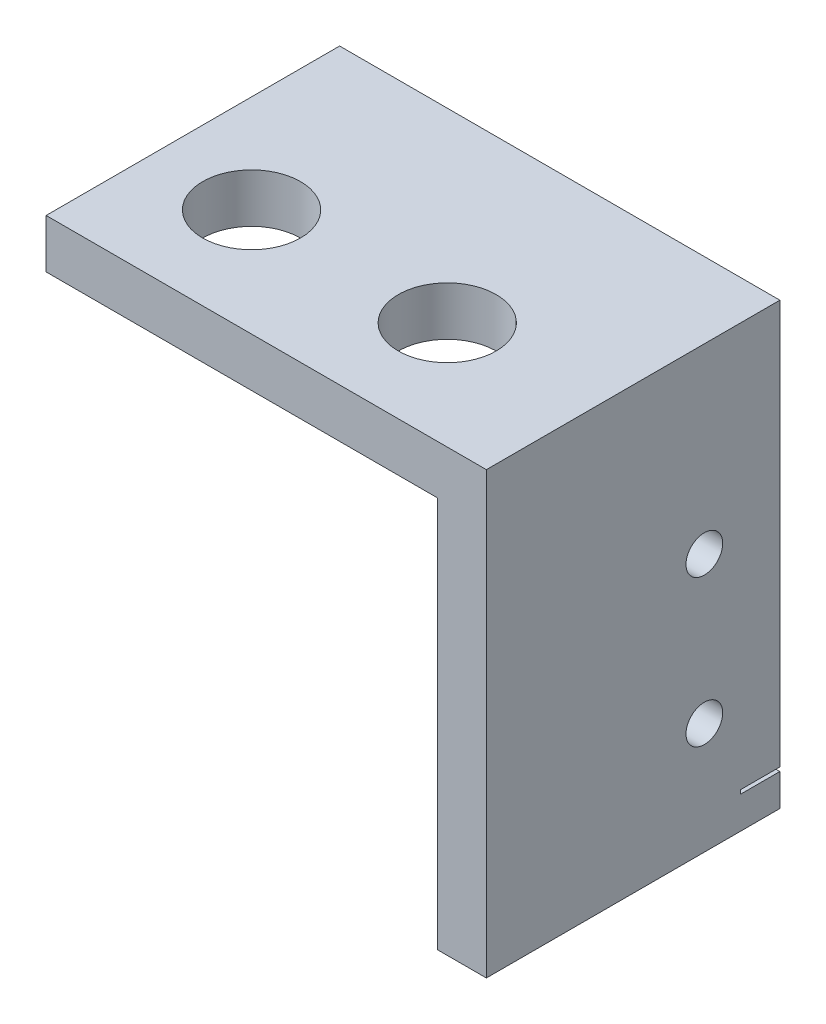
ISO-10303-21;
HEADER;
FILE_DESCRIPTION(('STEP AP214'),'2;1');
FILE_NAME('part.step','',(''),(''),'','','');
FILE_SCHEMA(('AUTOMOTIVE_DESIGN { 1 0 10303 214 1 1 1 1 }'));
ENDSEC;
DATA;
#1=APPLICATION_CONTEXT('core data for automotive mechanical design processes');
#2=APPLICATION_PROTOCOL_DEFINITION('international standard','automotive_design',2000,#1);
#3=PRODUCT_CONTEXT('',#1,'mechanical');
#4=PRODUCT('Part','Part','',(#3));
#5=PRODUCT_RELATED_PRODUCT_CATEGORY('part','',(#4));
#6=PRODUCT_DEFINITION_FORMATION('','',#4);
#7=PRODUCT_DEFINITION_CONTEXT('part definition',#1,'design');
#8=PRODUCT_DEFINITION('design','',#6,#7);
#9=PRODUCT_DEFINITION_SHAPE('','',#8);
#10=(LENGTH_UNIT() NAMED_UNIT(*) SI_UNIT(.MILLI.,.METRE.));
#11=(NAMED_UNIT(*) PLANE_ANGLE_UNIT() SI_UNIT($,.RADIAN.));
#12=(NAMED_UNIT(*) SI_UNIT($,.STERADIAN.) SOLID_ANGLE_UNIT());
#13=UNCERTAINTY_MEASURE_WITH_UNIT(LENGTH_MEASURE(1.E-05),#10,'distance_accuracy_value','');
#14=(GEOMETRIC_REPRESENTATION_CONTEXT(3) GLOBAL_UNCERTAINTY_ASSIGNED_CONTEXT((#13)) GLOBAL_UNIT_ASSIGNED_CONTEXT((#10,
#11,#12)) REPRESENTATION_CONTEXT('',''));
#15=CARTESIAN_POINT('',(0.,0.,0.));
#16=DIRECTION('',(0.,0.,1.));
#17=DIRECTION('',(1.,0.,0.));
#18=AXIS2_PLACEMENT_3D('',#15,#16,#17);
#19=CARTESIAN_POINT('',(0.,0.,0.));
#20=DIRECTION('',(0.,0.,1.));
#21=DIRECTION('',(1.,0.,0.));
#22=AXIS2_PLACEMENT_3D('',#19,#20,#21);
#23=PLANE('',#22);
#24=DIRECTION('',(0.,1.,0.));
#25=VECTOR('',#24,1.);
#26=CARTESIAN_POINT('',(0.,0.,0.));
#27=LINE('',#26,#25);
#28=CARTESIAN_POINT('',(0.,-23.0632,0.));
#29=VERTEX_POINT('',#28);
#30=CARTESIAN_POINT('',(0.,3.175,0.));
#31=VERTEX_POINT('',#30);
#32=EDGE_CURVE('E142',#29,#31,#27,.T.);
#33=ORIENTED_EDGE('',*,*,#32,.F.);
#34=DIRECTION('',(-1.,0.,0.));
#35=VECTOR('',#34,1.);
#36=CARTESIAN_POINT('',(0.00100000000000664,-23.0632,0.));
#37=LINE('',#36,#35);
#38=CARTESIAN_POINT('',(-3.175,-23.0632,0.));
#39=VERTEX_POINT('',#38);
#40=EDGE_CURVE('E162',#29,#39,#37,.T.);
#41=ORIENTED_EDGE('',*,*,#40,.T.);
#42=DIRECTION('',(0.,-1.,0.));
#43=VECTOR('',#42,1.);
#44=CARTESIAN_POINT('',(-3.175,0.,0.));
#45=LINE('',#44,#43);
#46=CARTESIAN_POINT('',(-3.175,0.,0.));
#47=VERTEX_POINT('',#46);
#48=EDGE_CURVE('E138',#47,#39,#45,.T.);
#49=ORIENTED_EDGE('',*,*,#48,.F.);
#50=DIRECTION('',(-1.,0.,0.));
#51=VECTOR('',#50,1.);
#52=CARTESIAN_POINT('',(0.,0.,0.));
#53=LINE('',#52,#51);
#54=CARTESIAN_POINT('',(-28.575,0.,0.));
#55=VERTEX_POINT('',#54);
#56=EDGE_CURVE('E133',#47,#55,#53,.T.);
#57=ORIENTED_EDGE('',*,*,#56,.T.);
#58=DIRECTION('',(0.,1.,0.));
#59=VECTOR('',#58,1.);
#60=CARTESIAN_POINT('',(-28.575,0.,0.));
#61=LINE('',#60,#59);
#62=CARTESIAN_POINT('',(-28.575,3.175,0.));
#63=VERTEX_POINT('',#62);
#64=EDGE_CURVE('E130',#55,#63,#61,.T.);
#65=ORIENTED_EDGE('',*,*,#64,.T.);
#66=DIRECTION('',(-1.,0.,0.));
#67=VECTOR('',#66,1.);
#68=CARTESIAN_POINT('',(0.,3.175,0.));
#69=LINE('',#68,#67);
#70=EDGE_CURVE('E145',#31,#63,#69,.T.);
#71=ORIENTED_EDGE('',*,*,#70,.F.);
#72=EDGE_LOOP('',(#33,#41,#49,#57,#65,#71));
#73=FACE_BOUND('',#72,.T.);
#74=ADVANCED_FACE('F33',(#73),#23,.F.);
#75=CARTESIAN_POINT('',(-28.575,0.,19.05));
#76=DIRECTION('',(-1.,0.,0.));
#77=DIRECTION('',(0.,0.,1.));
#78=AXIS2_PLACEMENT_3D('',#75,#76,#77);
#79=PLANE('',#78);
#80=ORIENTED_EDGE('',*,*,#64,.F.);
#81=DIRECTION('',(0.,0.,-1.));
#82=VECTOR('',#81,1.);
#83=CARTESIAN_POINT('',(-28.575,0.,19.05));
#84=LINE('',#83,#82);
#85=CARTESIAN_POINT('',(-28.575,0.,19.05));
#86=VERTEX_POINT('',#85);
#87=EDGE_CURVE('E11',#86,#55,#84,.T.);
#88=ORIENTED_EDGE('',*,*,#87,.F.);
#89=DIRECTION('',(0.,1.,0.));
#90=VECTOR('',#89,1.);
#91=CARTESIAN_POINT('',(-28.575,0.,19.05));
#92=LINE('',#91,#90);
#93=CARTESIAN_POINT('',(-28.575,3.175,19.05));
#94=VERTEX_POINT('',#93);
#95=EDGE_CURVE('E147',#86,#94,#92,.T.);
#96=ORIENTED_EDGE('',*,*,#95,.T.);
#97=DIRECTION('',(0.,0.,-1.));
#98=VECTOR('',#97,1.);
#99=CARTESIAN_POINT('',(-28.575,3.175,19.05));
#100=LINE('',#99,#98);
#101=EDGE_CURVE('E83',#94,#63,#100,.T.);
#102=ORIENTED_EDGE('',*,*,#101,.T.);
#103=EDGE_LOOP('',(#80,#88,#96,#102));
#104=FACE_BOUND('',#103,.T.);
#105=ADVANCED_FACE('F35',(#104),#79,.T.);
#106=CARTESIAN_POINT('',(0.,0.,19.05));
#107=DIRECTION('',(0.,-1.,0.));
#108=DIRECTION('',(1.,0.,0.));
#109=AXIS2_PLACEMENT_3D('',#106,#107,#108);
#110=PLANE('',#109);
#111=CARTESIAN_POINT('',(-22.225,0.,12.065));
#112=DIRECTION('',(0.,-1.,0.));
#113=DIRECTION('',(1.,0.,0.));
#114=AXIS2_PLACEMENT_3D('',#111,#112,#113);
#115=CIRCLE('',#114,3.175);
#116=CARTESIAN_POINT('',(-19.05,0.,12.065));
#117=VERTEX_POINT('',#116);
#118=EDGE_CURVE('E214',#117,#117,#115,.T.);
#119=ORIENTED_EDGE('',*,*,#118,.F.);
#120=EDGE_LOOP('',(#119));
#121=FACE_BOUND('',#120,.T.);
#122=CARTESIAN_POINT('',(-9.525,0.,12.065));
#123=DIRECTION('',(0.,-1.,0.));
#124=DIRECTION('',(1.,0.,0.));
#125=AXIS2_PLACEMENT_3D('',#122,#123,#124);
#126=CIRCLE('',#125,3.175);
#127=CARTESIAN_POINT('',(-6.35,0.,12.065));
#128=VERTEX_POINT('',#127);
#129=EDGE_CURVE('E208',#128,#128,#126,.T.);
#130=ORIENTED_EDGE('',*,*,#129,.F.);
#131=EDGE_LOOP('',(#130));
#132=FACE_BOUND('',#131,.T.);
#133=ORIENTED_EDGE('',*,*,#56,.F.);
#134=DIRECTION('',(0.,0.,-1.));
#135=VECTOR('',#134,1.);
#136=CARTESIAN_POINT('',(-3.175,0.,19.05));
#137=LINE('',#136,#135);
#138=CARTESIAN_POINT('',(-3.175,0.,19.05));
#139=VERTEX_POINT('',#138);
#140=EDGE_CURVE('E41',#139,#47,#137,.T.);
#141=ORIENTED_EDGE('',*,*,#140,.F.);
#142=DIRECTION('',(-1.,0.,0.));
#143=VECTOR('',#142,1.);
#144=CARTESIAN_POINT('',(0.,0.,19.05));
#145=LINE('',#144,#143);
#146=EDGE_CURVE('E125',#139,#86,#145,.T.);
#147=ORIENTED_EDGE('',*,*,#146,.T.);
#148=ORIENTED_EDGE('',*,*,#87,.T.);
#149=EDGE_LOOP('',(#133,#141,#147,#148));
#150=FACE_BOUND('',#149,.T.);
#151=ADVANCED_FACE('F163',(#121,#132,#150),#110,.T.);
#152=CARTESIAN_POINT('',(-3.175,0.,19.05));
#153=DIRECTION('',(1.,0.,0.));
#154=DIRECTION('',(0.,1.,0.));
#155=AXIS2_PLACEMENT_3D('',#152,#153,#154);
#156=PLANE('',#155);
#157=CARTESIAN_POINT('',(-3.175,-18.161,4.9022));
#158=DIRECTION('',(-1.,0.,0.));
#159=DIRECTION('',(0.,-1.,0.));
#160=AXIS2_PLACEMENT_3D('',#157,#158,#159);
#161=CIRCLE('',#160,1.19062500000001);
#162=CARTESIAN_POINT('',(-3.175,-19.351625,4.9022));
#163=VERTEX_POINT('',#162);
#164=EDGE_CURVE('E177',#163,#163,#161,.T.);
#165=ORIENTED_EDGE('',*,*,#164,.F.);
#166=EDGE_LOOP('',(#165));
#167=FACE_BOUND('',#166,.T.);
#168=CARTESIAN_POINT('',(-3.175,-8.636,4.9022));
#169=DIRECTION('',(-1.,0.,0.));
#170=DIRECTION('',(0.,-1.,0.));
#171=AXIS2_PLACEMENT_3D('',#168,#169,#170);
#172=CIRCLE('',#171,1.190625);
#173=CARTESIAN_POINT('',(-3.175,-9.82662500000001,4.9022));
#174=VERTEX_POINT('',#173);
#175=EDGE_CURVE('E171',#174,#174,#172,.T.);
#176=ORIENTED_EDGE('',*,*,#175,.F.);
#177=EDGE_LOOP('',(#176));
#178=FACE_BOUND('',#177,.T.);
#179=ORIENTED_EDGE('',*,*,#48,.T.);
#180=DIRECTION('',(0.,0.,-1.));
#181=VECTOR('',#180,1.);
#182=CARTESIAN_POINT('',(-3.175,-23.0632,0.));
#183=LINE('',#182,#181);
#184=CARTESIAN_POINT('',(-3.175,-23.0632,2.54));
#185=VERTEX_POINT('',#184);
#186=EDGE_CURVE('E184',#185,#39,#183,.T.);
#187=ORIENTED_EDGE('',*,*,#186,.F.);
#188=DIRECTION('',(0.,1.,0.));
#189=VECTOR('',#188,1.);
#190=CARTESIAN_POINT('',(-3.175,-23.0632,2.54));
#191=LINE('',#190,#189);
#192=CARTESIAN_POINT('',(-3.175,-23.3172,2.54));
#193=VERTEX_POINT('',#192);
#194=EDGE_CURVE('E193',#193,#185,#191,.T.);
#195=ORIENTED_EDGE('',*,*,#194,.F.);
#196=DIRECTION('',(0.,0.,1.));
#197=VECTOR('',#196,1.);
#198=CARTESIAN_POINT('',(-3.175,-23.3172,0.));
#199=LINE('',#198,#197);
#200=CARTESIAN_POINT('',(-3.175,-23.3172,0.));
#201=VERTEX_POINT('',#200);
#202=EDGE_CURVE('E196',#201,#193,#199,.T.);
#203=ORIENTED_EDGE('',*,*,#202,.F.);
#204=CARTESIAN_POINT('',(-3.175,-25.4,0.));
#205=VERTEX_POINT('',#204);
#206=EDGE_CURVE('E137',#201,#205,#45,.T.);
#207=ORIENTED_EDGE('',*,*,#206,.T.);
#208=DIRECTION('',(0.,0.,-1.));
#209=VECTOR('',#208,1.);
#210=CARTESIAN_POINT('',(-3.175,-25.4,19.05));
#211=LINE('',#210,#209);
#212=CARTESIAN_POINT('',(-3.175,-25.4,19.05));
#213=VERTEX_POINT('',#212);
#214=EDGE_CURVE('E110',#213,#205,#211,.T.);
#215=ORIENTED_EDGE('',*,*,#214,.F.);
#216=DIRECTION('',(0.,-1.,0.));
#217=VECTOR('',#216,1.);
#218=CARTESIAN_POINT('',(-3.175,0.,19.05));
#219=LINE('',#218,#217);
#220=EDGE_CURVE('E122',#139,#213,#219,.T.);
#221=ORIENTED_EDGE('',*,*,#220,.F.);
#222=ORIENTED_EDGE('',*,*,#140,.T.);
#223=EDGE_LOOP('',(#179,#187,#195,#203,#207,#215,#221,#222));
#224=FACE_BOUND('',#223,.T.);
#225=ADVANCED_FACE('F152',(#167,#178,#224),#156,.F.);
#226=CARTESIAN_POINT('',(0.,-25.4,19.05));
#227=DIRECTION('',(0.,-1.,0.));
#228=DIRECTION('',(0.,0.,-1.));
#229=AXIS2_PLACEMENT_3D('',#226,#227,#228);
#230=PLANE('',#229);
#231=DIRECTION('',(-1.,0.,0.));
#232=VECTOR('',#231,1.);
#233=CARTESIAN_POINT('',(0.,-25.4,0.));
#234=LINE('',#233,#232);
#235=CARTESIAN_POINT('',(0.,-25.4,0.));
#236=VERTEX_POINT('',#235);
#237=EDGE_CURVE('E106',#236,#205,#234,.T.);
#238=ORIENTED_EDGE('',*,*,#237,.F.);
#239=DIRECTION('',(0.,0.,-1.));
#240=VECTOR('',#239,1.);
#241=CARTESIAN_POINT('',(0.,-25.4,19.05));
#242=LINE('',#241,#240);
#243=CARTESIAN_POINT('',(0.,-25.4,19.05));
#244=VERTEX_POINT('',#243);
#245=EDGE_CURVE('E99',#244,#236,#242,.T.);
#246=ORIENTED_EDGE('',*,*,#245,.F.);
#247=DIRECTION('',(-1.,0.,0.));
#248=VECTOR('',#247,1.);
#249=CARTESIAN_POINT('',(0.,-25.4,19.05));
#250=LINE('',#249,#248);
#251=EDGE_CURVE('E104',#244,#213,#250,.T.);
#252=ORIENTED_EDGE('',*,*,#251,.T.);
#253=ORIENTED_EDGE('',*,*,#214,.T.);
#254=EDGE_LOOP('',(#238,#246,#252,#253));
#255=FACE_BOUND('',#254,.T.);
#256=ADVANCED_FACE('F101',(#255),#230,.T.);
#257=CARTESIAN_POINT('',(0.,0.,19.05));
#258=DIRECTION('',(-1.,0.,0.));
#259=DIRECTION('',(0.,0.,1.));
#260=AXIS2_PLACEMENT_3D('',#257,#258,#259);
#261=PLANE('',#260);
#262=CARTESIAN_POINT('',(0.,-18.161,4.9022));
#263=DIRECTION('',(-1.,0.,0.));
#264=DIRECTION('',(0.,0.,1.));
#265=AXIS2_PLACEMENT_3D('',#262,#263,#264);
#266=CIRCLE('',#265,1.19062500000001);
#267=CARTESIAN_POINT('',(0.,-18.161,6.09282500000001));
#268=VERTEX_POINT('',#267);
#269=EDGE_CURVE('E174',#268,#268,#266,.F.);
#270=ORIENTED_EDGE('',*,*,#269,.F.);
#271=EDGE_LOOP('',(#270));
#272=FACE_BOUND('',#271,.T.);
#273=CARTESIAN_POINT('',(0.,-8.636,4.9022));
#274=DIRECTION('',(-1.,0.,0.));
#275=DIRECTION('',(0.,0.,1.));
#276=AXIS2_PLACEMENT_3D('',#273,#274,#275);
#277=CIRCLE('',#276,1.190625);
#278=CARTESIAN_POINT('',(0.,-8.636,6.092825));
#279=VERTEX_POINT('',#278);
#280=EDGE_CURVE('E134',#279,#279,#277,.F.);
#281=ORIENTED_EDGE('',*,*,#280,.F.);
#282=EDGE_LOOP('',(#281));
#283=FACE_BOUND('',#282,.T.);
#284=DIRECTION('',(0.,-1.,0.));
#285=VECTOR('',#284,1.);
#286=CARTESIAN_POINT('',(0.,-23.0632,2.54));
#287=LINE('',#286,#285);
#288=CARTESIAN_POINT('',(0.,-23.0632,2.54));
#289=VERTEX_POINT('',#288);
#290=CARTESIAN_POINT('',(0.,-23.3172,2.54));
#291=VERTEX_POINT('',#290);
#292=EDGE_CURVE('E202',#289,#291,#287,.T.);
#293=ORIENTED_EDGE('',*,*,#292,.F.);
#294=DIRECTION('',(0.,0.,1.));
#295=VECTOR('',#294,1.);
#296=CARTESIAN_POINT('',(0.,-23.0632,0.));
#297=LINE('',#296,#295);
#298=EDGE_CURVE('E199',#29,#289,#297,.T.);
#299=ORIENTED_EDGE('',*,*,#298,.F.);
#300=ORIENTED_EDGE('',*,*,#32,.T.);
#301=DIRECTION('',(0.,0.,-1.));
#302=VECTOR('',#301,1.);
#303=CARTESIAN_POINT('',(0.,3.175,19.05));
#304=LINE('',#303,#302);
#305=CARTESIAN_POINT('',(0.,3.175,19.05));
#306=VERTEX_POINT('',#305);
#307=EDGE_CURVE('E111',#306,#31,#304,.T.);
#308=ORIENTED_EDGE('',*,*,#307,.F.);
#309=DIRECTION('',(0.,1.,0.));
#310=VECTOR('',#309,1.);
#311=CARTESIAN_POINT('',(0.,0.,19.05));
#312=LINE('',#311,#310);
#313=EDGE_CURVE('E114',#244,#306,#312,.T.);
#314=ORIENTED_EDGE('',*,*,#313,.F.);
#315=ORIENTED_EDGE('',*,*,#245,.T.);
#316=CARTESIAN_POINT('',(0.,-23.3172,0.));
#317=VERTEX_POINT('',#316);
#318=EDGE_CURVE('E143',#236,#317,#27,.T.);
#319=ORIENTED_EDGE('',*,*,#318,.T.);
#320=DIRECTION('',(0.,0.,-1.));
#321=VECTOR('',#320,1.);
#322=CARTESIAN_POINT('',(0.,-23.3172,0.));
#323=LINE('',#322,#321);
#324=EDGE_CURVE('E48',#291,#317,#323,.T.);
#325=ORIENTED_EDGE('',*,*,#324,.F.);
#326=EDGE_LOOP('',(#293,#299,#300,#308,#314,#315,#319,#325));
#327=FACE_BOUND('',#326,.T.);
#328=ADVANCED_FACE('F116',(#272,#283,#327),#261,.F.);
#329=CARTESIAN_POINT('',(0.,3.175,19.05));
#330=DIRECTION('',(0.,-1.,0.));
#331=DIRECTION('',(1.,0.,0.));
#332=AXIS2_PLACEMENT_3D('',#329,#330,#331);
#333=PLANE('',#332);
#334=CARTESIAN_POINT('',(-22.225,3.175,12.065));
#335=DIRECTION('',(0.,-1.,0.));
#336=DIRECTION('',(1.,0.,0.));
#337=AXIS2_PLACEMENT_3D('',#334,#335,#336);
#338=CIRCLE('',#337,3.175);
#339=CARTESIAN_POINT('',(-19.05,3.175,12.065));
#340=VERTEX_POINT('',#339);
#341=EDGE_CURVE('E211',#340,#340,#338,.F.);
#342=ORIENTED_EDGE('',*,*,#341,.F.);
#343=EDGE_LOOP('',(#342));
#344=FACE_BOUND('',#343,.T.);
#345=CARTESIAN_POINT('',(-9.525,3.175,12.065));
#346=DIRECTION('',(0.,-1.,0.));
#347=DIRECTION('',(1.,0.,0.));
#348=AXIS2_PLACEMENT_3D('',#345,#346,#347);
#349=CIRCLE('',#348,3.175);
#350=CARTESIAN_POINT('',(-6.35,3.175,12.065));
#351=VERTEX_POINT('',#350);
#352=EDGE_CURVE('E205',#351,#351,#349,.F.);
#353=ORIENTED_EDGE('',*,*,#352,.F.);
#354=EDGE_LOOP('',(#353));
#355=FACE_BOUND('',#354,.T.);
#356=ORIENTED_EDGE('',*,*,#70,.T.);
#357=ORIENTED_EDGE('',*,*,#101,.F.);
#358=DIRECTION('',(-1.,0.,0.));
#359=VECTOR('',#358,1.);
#360=CARTESIAN_POINT('',(0.,3.175,19.05));
#361=LINE('',#360,#359);
#362=EDGE_CURVE('E57',#306,#94,#361,.T.);
#363=ORIENTED_EDGE('',*,*,#362,.F.);
#364=ORIENTED_EDGE('',*,*,#307,.T.);
#365=EDGE_LOOP('',(#356,#357,#363,#364));
#366=FACE_BOUND('',#365,.T.);
#367=ADVANCED_FACE('F166',(#344,#355,#366),#333,.F.);
#368=CARTESIAN_POINT('',(0.,0.,19.05));
#369=DIRECTION('',(0.,0.,1.));
#370=DIRECTION('',(1.,0.,0.));
#371=AXIS2_PLACEMENT_3D('',#368,#369,#370);
#372=PLANE('',#371);
#373=ORIENTED_EDGE('',*,*,#95,.F.);
#374=ORIENTED_EDGE('',*,*,#146,.F.);
#375=ORIENTED_EDGE('',*,*,#220,.T.);
#376=ORIENTED_EDGE('',*,*,#251,.F.);
#377=ORIENTED_EDGE('',*,*,#313,.T.);
#378=ORIENTED_EDGE('',*,*,#362,.T.);
#379=EDGE_LOOP('',(#373,#374,#375,#376,#377,#378));
#380=FACE_BOUND('',#379,.T.);
#381=ADVANCED_FACE('F119',(#380),#372,.T.);
#382=ORIENTED_EDGE('',*,*,#206,.F.);
#383=DIRECTION('',(-1.,0.,0.));
#384=VECTOR('',#383,1.);
#385=CARTESIAN_POINT('',(0.00100000000000664,-23.3172,0.));
#386=LINE('',#385,#384);
#387=EDGE_CURVE('E181',#317,#201,#386,.T.);
#388=ORIENTED_EDGE('',*,*,#387,.F.);
#389=ORIENTED_EDGE('',*,*,#318,.F.);
#390=ORIENTED_EDGE('',*,*,#237,.T.);
#391=EDGE_LOOP('',(#382,#388,#389,#390));
#392=FACE_BOUND('',#391,.T.);
#393=ADVANCED_FACE('F239',(#392),#23,.F.);
#394=CARTESIAN_POINT('',(0.0010000000000049,-8.636,4.9022));
#395=DIRECTION('',(-1.,0.,0.));
#396=DIRECTION('',(0.,-1.,0.));
#397=AXIS2_PLACEMENT_3D('',#394,#395,#396);
#398=CYLINDRICAL_SURFACE('',#397,1.190625);
#399=ORIENTED_EDGE('',*,*,#175,.T.);
#400=EDGE_LOOP('',(#399));
#401=FACE_BOUND('',#400,.T.);
#402=ORIENTED_EDGE('',*,*,#280,.T.);
#403=EDGE_LOOP('',(#402));
#404=FACE_BOUND('',#403,.T.);
#405=ADVANCED_FACE('F250',(#401,#404),#398,.F.);
#406=CARTESIAN_POINT('',(0.0010000000000062,-18.161,4.9022));
#407=DIRECTION('',(-1.,0.,0.));
#408=DIRECTION('',(0.,-1.,0.));
#409=AXIS2_PLACEMENT_3D('',#406,#407,#408);
#410=CYLINDRICAL_SURFACE('',#409,1.19062500000001);
#411=ORIENTED_EDGE('',*,*,#164,.T.);
#412=EDGE_LOOP('',(#411));
#413=FACE_BOUND('',#412,.T.);
#414=ORIENTED_EDGE('',*,*,#269,.T.);
#415=EDGE_LOOP('',(#414));
#416=FACE_BOUND('',#415,.T.);
#417=ADVANCED_FACE('F255',(#413,#416),#410,.F.);
#418=CARTESIAN_POINT('',(0.00100000000000664,-23.0632,0.));
#419=DIRECTION('',(0.,1.,0.));
#420=DIRECTION('',(-1.,0.,0.));
#421=AXIS2_PLACEMENT_3D('',#418,#419,#420);
#422=PLANE('',#421);
#423=ORIENTED_EDGE('',*,*,#298,.T.);
#424=DIRECTION('',(-1.,0.,0.));
#425=VECTOR('',#424,1.);
#426=CARTESIAN_POINT('',(0.00100000000000664,-23.0632,2.54));
#427=LINE('',#426,#425);
#428=EDGE_CURVE('E187',#289,#185,#427,.T.);
#429=ORIENTED_EDGE('',*,*,#428,.T.);
#430=ORIENTED_EDGE('',*,*,#186,.T.);
#431=ORIENTED_EDGE('',*,*,#40,.F.);
#432=EDGE_LOOP('',(#423,#429,#430,#431));
#433=FACE_BOUND('',#432,.T.);
#434=ADVANCED_FACE('F275',(#433),#422,.F.);
#435=CARTESIAN_POINT('',(0.00100000000000664,-23.0632,2.54));
#436=DIRECTION('',(0.,0.,1.));
#437=DIRECTION('',(1.,0.,0.));
#438=AXIS2_PLACEMENT_3D('',#435,#436,#437);
#439=PLANE('',#438);
#440=ORIENTED_EDGE('',*,*,#292,.T.);
#441=DIRECTION('',(-1.,0.,0.));
#442=VECTOR('',#441,1.);
#443=CARTESIAN_POINT('',(0.00100000000000664,-23.3172,2.54));
#444=LINE('',#443,#442);
#445=EDGE_CURVE('E183',#291,#193,#444,.T.);
#446=ORIENTED_EDGE('',*,*,#445,.T.);
#447=ORIENTED_EDGE('',*,*,#194,.T.);
#448=ORIENTED_EDGE('',*,*,#428,.F.);
#449=EDGE_LOOP('',(#440,#446,#447,#448));
#450=FACE_BOUND('',#449,.T.);
#451=ADVANCED_FACE('F276',(#450),#439,.F.);
#452=CARTESIAN_POINT('',(0.00100000000000664,-23.3172,0.));
#453=DIRECTION('',(0.,-1.,0.));
#454=DIRECTION('',(0.,0.,-1.));
#455=AXIS2_PLACEMENT_3D('',#452,#453,#454);
#456=PLANE('',#455);
#457=ORIENTED_EDGE('',*,*,#324,.T.);
#458=ORIENTED_EDGE('',*,*,#387,.T.);
#459=ORIENTED_EDGE('',*,*,#202,.T.);
#460=ORIENTED_EDGE('',*,*,#445,.F.);
#461=EDGE_LOOP('',(#457,#458,#459,#460));
#462=FACE_BOUND('',#461,.T.);
#463=ADVANCED_FACE('F228',(#462),#456,.F.);
#464=CARTESIAN_POINT('',(-9.525,3.176,12.065));
#465=DIRECTION('',(0.,-1.,0.));
#466=DIRECTION('',(1.,0.,0.));
#467=AXIS2_PLACEMENT_3D('',#464,#465,#466);
#468=CYLINDRICAL_SURFACE('',#467,3.175);
#469=ORIENTED_EDGE('',*,*,#129,.T.);
#470=EDGE_LOOP('',(#469));
#471=FACE_BOUND('',#470,.T.);
#472=ORIENTED_EDGE('',*,*,#352,.T.);
#473=EDGE_LOOP('',(#472));
#474=FACE_BOUND('',#473,.T.);
#475=ADVANCED_FACE('F225',(#471,#474),#468,.F.);
#476=CARTESIAN_POINT('',(-22.225,3.176,12.065));
#477=DIRECTION('',(0.,-1.,0.));
#478=DIRECTION('',(1.,0.,0.));
#479=AXIS2_PLACEMENT_3D('',#476,#477,#478);
#480=CYLINDRICAL_SURFACE('',#479,3.175);
#481=ORIENTED_EDGE('',*,*,#118,.T.);
#482=EDGE_LOOP('',(#481));
#483=FACE_BOUND('',#482,.T.);
#484=ORIENTED_EDGE('',*,*,#341,.T.);
#485=EDGE_LOOP('',(#484));
#486=FACE_BOUND('',#485,.T.);
#487=ADVANCED_FACE('F218',(#483,#486),#480,.F.);
#488=CLOSED_SHELL('',(#74,#105,#151,#225,#256,#328,#367,#381,#393,#405,#417,#434,#451,#463,#475,#487));
#489=MANIFOLD_SOLID_BREP('B2',#488);
#490=ADVANCED_BREP_SHAPE_REPRESENTATION('',(#18,#489),#14);
#491=SHAPE_DEFINITION_REPRESENTATION(#9,#490);
ENDSEC;
END-ISO-10303-21;
